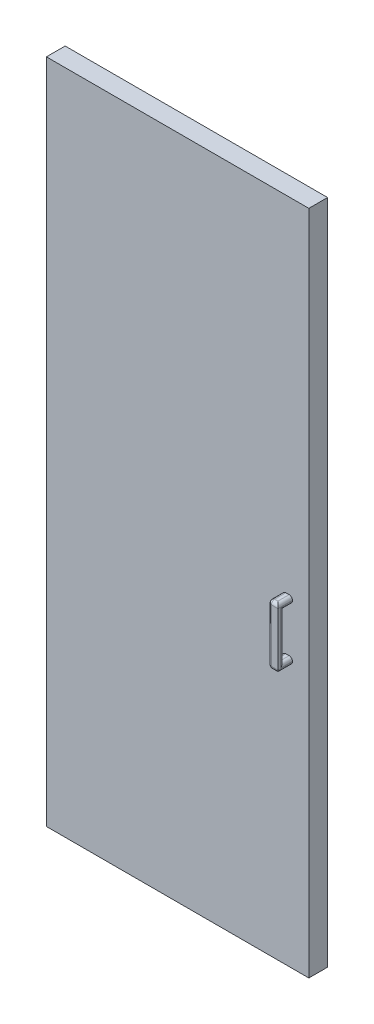
ISO-10303-21;
HEADER;
FILE_DESCRIPTION(('STEP AP214'),'2;1');
FILE_NAME('part.step','',(''),(''),'','','');
FILE_SCHEMA(('AUTOMOTIVE_DESIGN { 1 0 10303 214 1 1 1 1 }'));
ENDSEC;
DATA;
#1=APPLICATION_CONTEXT('core data for automotive mechanical design processes');
#2=APPLICATION_PROTOCOL_DEFINITION('international standard','automotive_design',2000,#1);
#3=PRODUCT_CONTEXT('',#1,'mechanical');
#4=PRODUCT('Part','Part','',(#3));
#5=PRODUCT_RELATED_PRODUCT_CATEGORY('part','',(#4));
#6=PRODUCT_DEFINITION_FORMATION('','',#4);
#7=PRODUCT_DEFINITION_CONTEXT('part definition',#1,'design');
#8=PRODUCT_DEFINITION('design','',#6,#7);
#9=PRODUCT_DEFINITION_SHAPE('','',#8);
#10=(LENGTH_UNIT() NAMED_UNIT(*) SI_UNIT(.MILLI.,.METRE.));
#11=(NAMED_UNIT(*) PLANE_ANGLE_UNIT() SI_UNIT($,.RADIAN.));
#12=(NAMED_UNIT(*) SI_UNIT($,.STERADIAN.) SOLID_ANGLE_UNIT());
#13=UNCERTAINTY_MEASURE_WITH_UNIT(LENGTH_MEASURE(1.E-05),#10,'distance_accuracy_value','');
#14=(GEOMETRIC_REPRESENTATION_CONTEXT(3) GLOBAL_UNCERTAINTY_ASSIGNED_CONTEXT((#13)) GLOBAL_UNIT_ASSIGNED_CONTEXT((#10,
#11,#12)) REPRESENTATION_CONTEXT('',''));
#15=CARTESIAN_POINT('',(0.,0.,0.));
#16=DIRECTION('',(0.,0.,1.));
#17=DIRECTION('',(1.,0.,0.));
#18=AXIS2_PLACEMENT_3D('',#15,#16,#17);
#19=CARTESIAN_POINT('',(0.,0.,0.));
#20=DIRECTION('',(0.,0.,1.));
#21=DIRECTION('',(1.,0.,0.));
#22=AXIS2_PLACEMENT_3D('',#19,#20,#21);
#23=PLANE('',#22);
#24=DIRECTION('',(-1.,0.,0.));
#25=VECTOR('',#24,1.);
#26=CARTESIAN_POINT('',(0.,446.201837212028,0.));
#27=LINE('',#26,#25);
#28=CARTESIAN_POINT('',(0.,446.201837212028,0.));
#29=VERTEX_POINT('',#28);
#30=CARTESIAN_POINT('',(-800.,446.201837212028,0.));
#31=VERTEX_POINT('',#30);
#32=EDGE_CURVE('E257',#29,#31,#27,.T.);
#33=ORIENTED_EDGE('',*,*,#32,.F.);
#34=DIRECTION('',(0.,1.,0.));
#35=VECTOR('',#34,1.);
#36=CARTESIAN_POINT('',(0.,0.,0.));
#37=LINE('',#36,#35);
#38=CARTESIAN_POINT('',(0.,-1585.79816278797,0.));
#39=VERTEX_POINT('',#38);
#40=EDGE_CURVE('E275',#39,#29,#37,.T.);
#41=ORIENTED_EDGE('',*,*,#40,.F.);
#42=DIRECTION('',(1.,0.,0.));
#43=VECTOR('',#42,1.);
#44=CARTESIAN_POINT('',(-800.,-1585.79816278797,0.));
#45=LINE('',#44,#43);
#46=CARTESIAN_POINT('',(-800.,-1585.79816278797,0.));
#47=VERTEX_POINT('',#46);
#48=EDGE_CURVE('E286',#47,#39,#45,.T.);
#49=ORIENTED_EDGE('',*,*,#48,.F.);
#50=DIRECTION('',(0.,-1.,0.));
#51=VECTOR('',#50,1.);
#52=CARTESIAN_POINT('',(-800.,446.201837212028,0.));
#53=LINE('',#52,#51);
#54=EDGE_CURVE('E284',#31,#47,#53,.T.);
#55=ORIENTED_EDGE('',*,*,#54,.F.);
#56=EDGE_LOOP('',(#33,#41,#49,#55));
#57=FACE_BOUND('',#56,.T.);
#58=DIRECTION('',(0.,1.,0.));
#59=VECTOR('',#58,1.);
#60=CARTESIAN_POINT('',(-145.,-924.798162787972,0.));
#61=LINE('',#60,#59);
#62=CARTESIAN_POINT('',(-145.,-924.798162787972,0.));
#63=VERTEX_POINT('',#62);
#64=CARTESIAN_POINT('',(-145.,-464.798162787972,0.));
#65=VERTEX_POINT('',#64);
#66=EDGE_CURVE('E233',#63,#65,#61,.T.);
#67=ORIENTED_EDGE('',*,*,#66,.F.);
#68=DIRECTION('',(-1.,0.,0.));
#69=VECTOR('',#68,1.);
#70=CARTESIAN_POINT('',(-25.,-924.798162787972,0.));
#71=LINE('',#70,#69);
#72=CARTESIAN_POINT('',(-25.,-924.798162787972,0.));
#73=VERTEX_POINT('',#72);
#74=EDGE_CURVE('E230',#73,#63,#71,.T.);
#75=ORIENTED_EDGE('',*,*,#74,.F.);
#76=DIRECTION('',(0.,-1.,0.));
#77=VECTOR('',#76,1.);
#78=CARTESIAN_POINT('',(-25.,-924.798162787972,0.));
#79=LINE('',#78,#77);
#80=CARTESIAN_POINT('',(-25.,-464.798162787972,0.));
#81=VERTEX_POINT('',#80);
#82=EDGE_CURVE('E61',#81,#73,#79,.T.);
#83=ORIENTED_EDGE('',*,*,#82,.F.);
#84=DIRECTION('',(1.,0.,0.));
#85=VECTOR('',#84,1.);
#86=CARTESIAN_POINT('',(-25.,-464.798162787972,0.));
#87=LINE('',#86,#85);
#88=EDGE_CURVE('E56',#65,#81,#87,.T.);
#89=ORIENTED_EDGE('',*,*,#88,.F.);
#90=EDGE_LOOP('',(#67,#75,#83,#89));
#91=FACE_BOUND('',#90,.T.);
#92=ADVANCED_FACE('F39',(#57,#91),#23,.F.);
#93=CARTESIAN_POINT('',(-79.9999999999999,-603.798162787972,101.15));
#94=DIRECTION('',(1.,0.,0.));
#95=DIRECTION('',(0.,1.,0.));
#96=AXIS2_PLACEMENT_3D('',#93,#94,#95);
#97=PLANE('',#96);
#98=DIRECTION('',(0.,-1.,0.));
#99=VECTOR('',#98,1.);
#100=CARTESIAN_POINT('',(-79.9999999999999,-603.798162787972,57.15));
#101=LINE('',#100,#99);
#102=CARTESIAN_POINT('',(-79.9999999999999,-774.798162787972,57.15));
#103=VERTEX_POINT('',#102);
#104=CARTESIAN_POINT('',(-79.9999999999999,-775.798162787972,57.15));
#105=VERTEX_POINT('',#104);
#106=EDGE_CURVE('E265',#103,#105,#101,.T.);
#107=ORIENTED_EDGE('',*,*,#106,.T.);
#108=DIRECTION('',(0.,0.,-1.));
#109=VECTOR('',#108,1.);
#110=CARTESIAN_POINT('',(-79.9999999999999,-775.798162787972,101.15));
#111=LINE('',#110,#109);
#112=CARTESIAN_POINT('',(-79.9999999999999,-775.798162787972,91.15));
#113=VERTEX_POINT('',#112);
#114=EDGE_CURVE('E328',#105,#113,#111,.F.);
#115=ORIENTED_EDGE('',*,*,#114,.T.);
#116=DIRECTION('',(0.,-1.,0.));
#117=VECTOR('',#116,1.);
#118=CARTESIAN_POINT('',(-79.9999999999999,-603.798162787972,91.15));
#119=LINE('',#118,#117);
#120=CARTESIAN_POINT('',(-79.9999999999999,-774.798162787972,91.15));
#121=VERTEX_POINT('',#120);
#122=EDGE_CURVE('E324',#113,#121,#119,.F.);
#123=ORIENTED_EDGE('',*,*,#122,.T.);
#124=DIRECTION('',(0.,0.,-1.));
#125=VECTOR('',#124,1.);
#126=CARTESIAN_POINT('',(-79.9999999999999,-774.798162787972,57.15));
#127=LINE('',#126,#125);
#128=EDGE_CURVE('E326',#121,#103,#127,.T.);
#129=ORIENTED_EDGE('',*,*,#128,.T.);
#130=EDGE_LOOP('',(#107,#115,#123,#129));
#131=FACE_BOUND('',#130,.T.);
#132=ADVANCED_FACE('F497',(#131),#97,.F.);
#133=CARTESIAN_POINT('',(-49.9999999999999,-603.798162787972,101.15));
#134=DIRECTION('',(-1.,0.,0.));
#135=DIRECTION('',(0.,-1.,0.));
#136=AXIS2_PLACEMENT_3D('',#133,#134,#135);
#137=PLANE('',#136);
#138=DIRECTION('',(0.,1.,0.));
#139=VECTOR('',#138,1.);
#140=CARTESIAN_POINT('',(-49.9999999999999,-603.798162787972,57.15));
#141=LINE('',#140,#139);
#142=CARTESIAN_POINT('',(-49.9999999999999,-614.798162787972,57.15));
#143=VERTEX_POINT('',#142);
#144=CARTESIAN_POINT('',(-49.9999999999999,-613.798162787972,57.15));
#145=VERTEX_POINT('',#144);
#146=EDGE_CURVE('E243',#143,#145,#141,.T.);
#147=ORIENTED_EDGE('',*,*,#146,.T.);
#148=DIRECTION('',(0.,0.,-1.));
#149=VECTOR('',#148,1.);
#150=CARTESIAN_POINT('',(-49.9999999999999,-613.798162787972,101.15));
#151=LINE('',#150,#149);
#152=CARTESIAN_POINT('',(-49.9999999999999,-613.798162787972,101.15));
#153=VERTEX_POINT('',#152);
#154=EDGE_CURVE('E343',#145,#153,#151,.F.);
#155=ORIENTED_EDGE('',*,*,#154,.T.);
#156=DIRECTION('',(0.,1.,0.));
#157=VECTOR('',#156,1.);
#158=CARTESIAN_POINT('',(-49.9999999999999,-603.798162787972,101.15));
#159=LINE('',#158,#157);
#160=CARTESIAN_POINT('',(-49.9999999999999,-775.798162787972,101.15));
#161=VERTEX_POINT('',#160);
#162=EDGE_CURVE('E254',#161,#153,#159,.T.);
#163=ORIENTED_EDGE('',*,*,#162,.F.);
#164=DIRECTION('',(0.,0.,-1.));
#165=VECTOR('',#164,1.);
#166=CARTESIAN_POINT('',(-49.9999999999999,-775.798162787972,101.15));
#167=LINE('',#166,#165);
#168=CARTESIAN_POINT('',(-49.9999999999999,-775.798162787972,57.15));
#169=VERTEX_POINT('',#168);
#170=EDGE_CURVE('E335',#161,#169,#167,.T.);
#171=ORIENTED_EDGE('',*,*,#170,.T.);
#172=CARTESIAN_POINT('',(-49.9999999999999,-774.798162787972,57.15));
#173=VERTEX_POINT('',#172);
#174=EDGE_CURVE('E259',#169,#173,#141,.T.);
#175=ORIENTED_EDGE('',*,*,#174,.T.);
#176=DIRECTION('',(0.,0.,-1.));
#177=VECTOR('',#176,1.);
#178=CARTESIAN_POINT('',(-49.9999999999999,-774.798162787972,83.15));
#179=LINE('',#178,#177);
#180=CARTESIAN_POINT('',(-49.9999999999999,-774.798162787972,93.15));
#181=VERTEX_POINT('',#180);
#182=EDGE_CURVE('E337',#173,#181,#179,.F.);
#183=ORIENTED_EDGE('',*,*,#182,.T.);
#184=DIRECTION('',(0.,-1.,0.));
#185=VECTOR('',#184,1.);
#186=CARTESIAN_POINT('',(-49.9999999999999,-624.798162787972,93.15));
#187=LINE('',#186,#185);
#188=CARTESIAN_POINT('',(-49.9999999999999,-614.798162787972,93.15));
#189=VERTEX_POINT('',#188);
#190=EDGE_CURVE('E339',#181,#189,#187,.F.);
#191=ORIENTED_EDGE('',*,*,#190,.T.);
#192=DIRECTION('',(0.,0.,1.));
#193=VECTOR('',#192,1.);
#194=CARTESIAN_POINT('',(-49.9999999999999,-614.798162787972,57.15));
#195=LINE('',#194,#193);
#196=EDGE_CURVE('E341',#189,#143,#195,.F.);
#197=ORIENTED_EDGE('',*,*,#196,.T.);
#198=EDGE_LOOP('',(#147,#155,#163,#171,#175,#183,#191,#197));
#199=FACE_BOUND('',#198,.T.);
#200=ADVANCED_FACE('F417',(#199),#137,.F.);
#201=DIRECTION('',(0.,-1.,0.));
#202=VECTOR('',#201,1.);
#203=CARTESIAN_POINT('',(-79.9999999999999,-603.798162787972,91.15));
#204=LINE('',#203,#202);
#205=CARTESIAN_POINT('',(-79.9999999999999,-614.798162787972,91.15));
#206=VERTEX_POINT('',#205);
#207=CARTESIAN_POINT('',(-79.9999999999999,-613.798162787972,91.15));
#208=VERTEX_POINT('',#207);
#209=EDGE_CURVE('E318',#206,#208,#204,.F.);
#210=ORIENTED_EDGE('',*,*,#209,.T.);
#211=DIRECTION('',(0.,0.,-1.));
#212=VECTOR('',#211,1.);
#213=CARTESIAN_POINT('',(-79.9999999999999,-613.798162787972,101.15));
#214=LINE('',#213,#212);
#215=CARTESIAN_POINT('',(-79.9999999999999,-613.798162787972,57.15));
#216=VERTEX_POINT('',#215);
#217=EDGE_CURVE('E322',#208,#216,#214,.T.);
#218=ORIENTED_EDGE('',*,*,#217,.T.);
#219=CARTESIAN_POINT('',(-79.9999999999999,-614.798162787972,57.15));
#220=VERTEX_POINT('',#219);
#221=EDGE_CURVE('E266',#216,#220,#101,.T.);
#222=ORIENTED_EDGE('',*,*,#221,.T.);
#223=DIRECTION('',(0.,0.,1.));
#224=VECTOR('',#223,1.);
#225=CARTESIAN_POINT('',(-79.9999999999999,-614.798162787972,83.15));
#226=LINE('',#225,#224);
#227=EDGE_CURVE('E320',#220,#206,#226,.T.);
#228=ORIENTED_EDGE('',*,*,#227,.T.);
#229=EDGE_LOOP('',(#210,#218,#222,#228));
#230=FACE_BOUND('',#229,.T.);
#231=ADVANCED_FACE('F503',(#230),#97,.F.);
#232=CARTESIAN_POINT('',(0.,0.,57.15));
#233=DIRECTION('',(0.,0.,1.));
#234=DIRECTION('',(1.,0.,0.));
#235=AXIS2_PLACEMENT_3D('',#232,#233,#234);
#236=PLANE('',#235);
#237=DIRECTION('',(-1.,0.,0.));
#238=VECTOR('',#237,1.);
#239=CARTESIAN_POINT('',(-35.9999999999999,-764.798162787972,57.15));
#240=LINE('',#239,#238);
#241=CARTESIAN_POINT('',(-59.9999999999999,-764.798162787972,57.15));
#242=VERTEX_POINT('',#241);
#243=CARTESIAN_POINT('',(-69.9999999999999,-764.798162787972,57.15));
#244=VERTEX_POINT('',#243);
#245=EDGE_CURVE('E240',#242,#244,#240,.T.);
#246=ORIENTED_EDGE('',*,*,#245,.F.);
#247=CARTESIAN_POINT('',(-59.9999999999999,-774.798162787972,57.15));
#248=DIRECTION('',(0.,0.,1.));
#249=DIRECTION('',(1.,0.,0.));
#250=AXIS2_PLACEMENT_3D('',#247,#248,#249);
#251=CIRCLE('',#250,10.);
#252=EDGE_CURVE('E363',#242,#173,#251,.F.);
#253=ORIENTED_EDGE('',*,*,#252,.T.);
#254=ORIENTED_EDGE('',*,*,#174,.F.);
#255=CARTESIAN_POINT('',(-59.9999999999999,-775.798162787972,57.15));
#256=DIRECTION('',(0.,0.,1.));
#257=DIRECTION('',(1.,0.,0.));
#258=AXIS2_PLACEMENT_3D('',#255,#256,#257);
#259=CIRCLE('',#258,10.);
#260=CARTESIAN_POINT('',(-59.9999999999999,-785.798162787972,57.15));
#261=VERTEX_POINT('',#260);
#262=EDGE_CURVE('E365',#169,#261,#259,.F.);
#263=ORIENTED_EDGE('',*,*,#262,.T.);
#264=DIRECTION('',(1.,0.,0.));
#265=VECTOR('',#264,1.);
#266=CARTESIAN_POINT('',(-79.9999999999999,-785.798162787972,57.15));
#267=LINE('',#266,#265);
#268=CARTESIAN_POINT('',(-69.9999999999999,-785.798162787972,57.15));
#269=VERTEX_POINT('',#268);
#270=EDGE_CURVE('E258',#269,#261,#267,.T.);
#271=ORIENTED_EDGE('',*,*,#270,.F.);
#272=CARTESIAN_POINT('',(-69.9999999999999,-775.798162787972,57.15));
#273=DIRECTION('',(0.,0.,1.));
#274=DIRECTION('',(1.,0.,0.));
#275=AXIS2_PLACEMENT_3D('',#272,#273,#274);
#276=CIRCLE('',#275,10.);
#277=EDGE_CURVE('E48',#269,#105,#276,.F.);
#278=ORIENTED_EDGE('',*,*,#277,.T.);
#279=ORIENTED_EDGE('',*,*,#106,.F.);
#280=CARTESIAN_POINT('',(-69.9999999999999,-774.798162787972,57.15));
#281=DIRECTION('',(0.,0.,1.));
#282=DIRECTION('',(1.,0.,0.));
#283=AXIS2_PLACEMENT_3D('',#280,#281,#282);
#284=CIRCLE('',#283,10.);
#285=EDGE_CURVE('E11',#103,#244,#284,.F.);
#286=ORIENTED_EDGE('',*,*,#285,.T.);
#287=EDGE_LOOP('',(#246,#253,#254,#263,#271,#278,#279,#286));
#288=FACE_BOUND('',#287,.T.);
#289=ORIENTED_EDGE('',*,*,#146,.F.);
#290=CARTESIAN_POINT('',(-59.9999999999999,-614.798162787972,57.15));
#291=DIRECTION('',(0.,0.,1.));
#292=DIRECTION('',(1.,0.,0.));
#293=AXIS2_PLACEMENT_3D('',#290,#291,#292);
#294=CIRCLE('',#293,10.);
#295=CARTESIAN_POINT('',(-59.9999999999999,-624.798162787972,57.15));
#296=VERTEX_POINT('',#295);
#297=EDGE_CURVE('E361',#143,#296,#294,.F.);
#298=ORIENTED_EDGE('',*,*,#297,.T.);
#299=DIRECTION('',(-1.,0.,0.));
#300=VECTOR('',#299,1.);
#301=CARTESIAN_POINT('',(-35.9999999999999,-624.798162787972,57.15));
#302=LINE('',#301,#300);
#303=CARTESIAN_POINT('',(-69.9999999999999,-624.798162787972,57.15));
#304=VERTEX_POINT('',#303);
#305=EDGE_CURVE('E244',#296,#304,#302,.T.);
#306=ORIENTED_EDGE('',*,*,#305,.T.);
#307=CARTESIAN_POINT('',(-69.9999999999999,-614.798162787972,57.15));
#308=DIRECTION('',(0.,0.,1.));
#309=DIRECTION('',(1.,0.,0.));
#310=AXIS2_PLACEMENT_3D('',#307,#308,#309);
#311=CIRCLE('',#310,10.);
#312=EDGE_CURVE('E357',#304,#220,#311,.F.);
#313=ORIENTED_EDGE('',*,*,#312,.T.);
#314=ORIENTED_EDGE('',*,*,#221,.F.);
#315=CARTESIAN_POINT('',(-69.9999999999999,-613.798162787972,57.15));
#316=DIRECTION('',(0.,0.,1.));
#317=DIRECTION('',(1.,0.,0.));
#318=AXIS2_PLACEMENT_3D('',#315,#316,#317);
#319=CIRCLE('',#318,10.);
#320=CARTESIAN_POINT('',(-69.9999999999999,-603.798162787972,57.15));
#321=VERTEX_POINT('',#320);
#322=EDGE_CURVE('E355',#216,#321,#319,.F.);
#323=ORIENTED_EDGE('',*,*,#322,.T.);
#324=DIRECTION('',(-1.,0.,0.));
#325=VECTOR('',#324,1.);
#326=CARTESIAN_POINT('',(-79.9999999999999,-603.798162787972,57.15));
#327=LINE('',#326,#325);
#328=CARTESIAN_POINT('',(-59.9999999999999,-603.798162787972,57.15));
#329=VERTEX_POINT('',#328);
#330=EDGE_CURVE('E262',#329,#321,#327,.T.);
#331=ORIENTED_EDGE('',*,*,#330,.F.);
#332=CARTESIAN_POINT('',(-59.9999999999999,-613.798162787972,57.15));
#333=DIRECTION('',(0.,0.,1.));
#334=DIRECTION('',(1.,0.,0.));
#335=AXIS2_PLACEMENT_3D('',#332,#333,#334);
#336=CIRCLE('',#335,10.);
#337=EDGE_CURVE('E359',#329,#145,#336,.F.);
#338=ORIENTED_EDGE('',*,*,#337,.T.);
#339=EDGE_LOOP('',(#289,#298,#306,#313,#314,#323,#331,#338));
#340=FACE_BOUND('',#339,.T.);
#341=DIRECTION('',(-1.,0.,0.));
#342=VECTOR('',#341,1.);
#343=CARTESIAN_POINT('',(0.,446.201837212028,57.15));
#344=LINE('',#343,#342);
#345=CARTESIAN_POINT('',(0.,446.201837212028,57.15));
#346=VERTEX_POINT('',#345);
#347=CARTESIAN_POINT('',(-800.,446.201837212028,57.15));
#348=VERTEX_POINT('',#347);
#349=EDGE_CURVE('E271',#346,#348,#344,.T.);
#350=ORIENTED_EDGE('',*,*,#349,.T.);
#351=DIRECTION('',(0.,-1.,0.));
#352=VECTOR('',#351,1.);
#353=CARTESIAN_POINT('',(-800.,446.201837212028,57.15));
#354=LINE('',#353,#352);
#355=CARTESIAN_POINT('',(-800.,-1585.79816278797,57.15));
#356=VERTEX_POINT('',#355);
#357=EDGE_CURVE('E274',#348,#356,#354,.T.);
#358=ORIENTED_EDGE('',*,*,#357,.T.);
#359=DIRECTION('',(1.,0.,0.));
#360=VECTOR('',#359,1.);
#361=CARTESIAN_POINT('',(-800.,-1585.79816278797,57.15));
#362=LINE('',#361,#360);
#363=CARTESIAN_POINT('',(0.,-1585.79816278797,57.15));
#364=VERTEX_POINT('',#363);
#365=EDGE_CURVE('E277',#356,#364,#362,.T.);
#366=ORIENTED_EDGE('',*,*,#365,.T.);
#367=DIRECTION('',(0.,1.,0.));
#368=VECTOR('',#367,1.);
#369=CARTESIAN_POINT('',(0.,-1585.79816278797,57.15));
#370=LINE('',#369,#368);
#371=EDGE_CURVE('E279',#364,#346,#370,.T.);
#372=ORIENTED_EDGE('',*,*,#371,.T.);
#373=EDGE_LOOP('',(#350,#358,#366,#372));
#374=FACE_BOUND('',#373,.T.);
#375=ADVANCED_FACE('F421',(#288,#340,#374),#236,.T.);
#376=CARTESIAN_POINT('',(0.,446.201837212028,57.15));
#377=DIRECTION('',(0.,-1.,0.));
#378=DIRECTION('',(1.,0.,0.));
#379=AXIS2_PLACEMENT_3D('',#376,#377,#378);
#380=PLANE('',#379);
#381=ORIENTED_EDGE('',*,*,#32,.T.);
#382=DIRECTION('',(0.,0.,-1.));
#383=VECTOR('',#382,1.);
#384=CARTESIAN_POINT('',(-800.,446.201837212028,57.15));
#385=LINE('',#384,#383);
#386=EDGE_CURVE('E298',#348,#31,#385,.T.);
#387=ORIENTED_EDGE('',*,*,#386,.F.);
#388=ORIENTED_EDGE('',*,*,#349,.F.);
#389=DIRECTION('',(0.,0.,-1.));
#390=VECTOR('',#389,1.);
#391=CARTESIAN_POINT('',(0.,446.201837212028,57.15));
#392=LINE('',#391,#390);
#393=EDGE_CURVE('E281',#346,#29,#392,.T.);
#394=ORIENTED_EDGE('',*,*,#393,.T.);
#395=EDGE_LOOP('',(#381,#387,#388,#394));
#396=FACE_BOUND('',#395,.T.);
#397=ADVANCED_FACE('F544',(#396),#380,.F.);
#398=CARTESIAN_POINT('',(-800.,446.201837212028,57.15));
#399=DIRECTION('',(1.,0.,0.));
#400=DIRECTION('',(0.,1.,0.));
#401=AXIS2_PLACEMENT_3D('',#398,#399,#400);
#402=PLANE('',#401);
#403=ORIENTED_EDGE('',*,*,#54,.T.);
#404=DIRECTION('',(0.,0.,-1.));
#405=VECTOR('',#404,1.);
#406=CARTESIAN_POINT('',(-800.,-1585.79816278797,57.15));
#407=LINE('',#406,#405);
#408=EDGE_CURVE('E295',#356,#47,#407,.T.);
#409=ORIENTED_EDGE('',*,*,#408,.F.);
#410=ORIENTED_EDGE('',*,*,#357,.F.);
#411=ORIENTED_EDGE('',*,*,#386,.T.);
#412=EDGE_LOOP('',(#403,#409,#410,#411));
#413=FACE_BOUND('',#412,.T.);
#414=ADVANCED_FACE('F540',(#413),#402,.F.);
#415=CARTESIAN_POINT('',(-800.,-1585.79816278797,57.15));
#416=DIRECTION('',(0.,1.,0.));
#417=DIRECTION('',(0.,0.,1.));
#418=AXIS2_PLACEMENT_3D('',#415,#416,#417);
#419=PLANE('',#418);
#420=ORIENTED_EDGE('',*,*,#48,.T.);
#421=DIRECTION('',(0.,0.,-1.));
#422=VECTOR('',#421,1.);
#423=CARTESIAN_POINT('',(0.,-1585.79816278797,57.15));
#424=LINE('',#423,#422);
#425=EDGE_CURVE('E292',#364,#39,#424,.T.);
#426=ORIENTED_EDGE('',*,*,#425,.F.);
#427=ORIENTED_EDGE('',*,*,#365,.F.);
#428=ORIENTED_EDGE('',*,*,#408,.T.);
#429=EDGE_LOOP('',(#420,#426,#427,#428));
#430=FACE_BOUND('',#429,.T.);
#431=ADVANCED_FACE('F536',(#430),#419,.F.);
#432=CARTESIAN_POINT('',(0.,0.,57.15));
#433=DIRECTION('',(-1.,0.,0.));
#434=DIRECTION('',(0.,0.,1.));
#435=AXIS2_PLACEMENT_3D('',#432,#433,#434);
#436=PLANE('',#435);
#437=ORIENTED_EDGE('',*,*,#40,.T.);
#438=ORIENTED_EDGE('',*,*,#393,.F.);
#439=ORIENTED_EDGE('',*,*,#371,.F.);
#440=ORIENTED_EDGE('',*,*,#425,.T.);
#441=EDGE_LOOP('',(#437,#438,#439,#440));
#442=FACE_BOUND('',#441,.T.);
#443=ADVANCED_FACE('F533',(#442),#436,.F.);
#444=CARTESIAN_POINT('',(-79.9999999999999,-603.798162787972,101.15));
#445=DIRECTION('',(0.,-1.,0.));
#446=DIRECTION('',(0.,0.,-1.));
#447=AXIS2_PLACEMENT_3D('',#444,#445,#446);
#448=PLANE('',#447);
#449=ORIENTED_EDGE('',*,*,#330,.T.);
#450=DIRECTION('',(0.,0.,-1.));
#451=VECTOR('',#450,1.);
#452=CARTESIAN_POINT('',(-69.9999999999999,-603.798162787972,101.15));
#453=LINE('',#452,#451);
#454=CARTESIAN_POINT('',(-69.9999999999999,-603.798162787972,91.15));
#455=VERTEX_POINT('',#454);
#456=EDGE_CURVE('E312',#321,#455,#453,.F.);
#457=ORIENTED_EDGE('',*,*,#456,.T.);
#458=DIRECTION('',(-1.,0.,0.));
#459=VECTOR('',#458,1.);
#460=CARTESIAN_POINT('',(-49.9999999999999,-603.798162787972,91.15));
#461=LINE('',#460,#459);
#462=CARTESIAN_POINT('',(-59.9999999999999,-603.798162787972,91.15));
#463=VERTEX_POINT('',#462);
#464=EDGE_CURVE('E310',#455,#463,#461,.F.);
#465=ORIENTED_EDGE('',*,*,#464,.T.);
#466=DIRECTION('',(0.,0.,-1.));
#467=VECTOR('',#466,1.);
#468=CARTESIAN_POINT('',(-59.9999999999999,-603.798162787972,101.15));
#469=LINE('',#468,#467);
#470=EDGE_CURVE('E308',#463,#329,#469,.T.);
#471=ORIENTED_EDGE('',*,*,#470,.T.);
#472=EDGE_LOOP('',(#449,#457,#465,#471));
#473=FACE_BOUND('',#472,.T.);
#474=ADVANCED_FACE('F511',(#473),#448,.F.);
#475=CARTESIAN_POINT('',(-79.9999999999999,-785.798162787972,101.15));
#476=DIRECTION('',(0.,1.,0.));
#477=DIRECTION('',(0.,0.,1.));
#478=AXIS2_PLACEMENT_3D('',#475,#476,#477);
#479=PLANE('',#478);
#480=ORIENTED_EDGE('',*,*,#270,.T.);
#481=DIRECTION('',(0.,0.,-1.));
#482=VECTOR('',#481,1.);
#483=CARTESIAN_POINT('',(-59.9999999999999,-785.798162787972,101.15));
#484=LINE('',#483,#482);
#485=CARTESIAN_POINT('',(-59.9999999999999,-785.798162787972,91.15));
#486=VERTEX_POINT('',#485);
#487=EDGE_CURVE('E353',#261,#486,#484,.F.);
#488=ORIENTED_EDGE('',*,*,#487,.T.);
#489=DIRECTION('',(1.,0.,0.));
#490=VECTOR('',#489,1.);
#491=CARTESIAN_POINT('',(-79.9999999999999,-785.798162787972,91.15));
#492=LINE('',#491,#490);
#493=CARTESIAN_POINT('',(-69.9999999999999,-785.798162787972,91.15));
#494=VERTEX_POINT('',#493);
#495=EDGE_CURVE('E349',#486,#494,#492,.F.);
#496=ORIENTED_EDGE('',*,*,#495,.T.);
#497=DIRECTION('',(0.,0.,-1.));
#498=VECTOR('',#497,1.);
#499=CARTESIAN_POINT('',(-69.9999999999999,-785.798162787972,101.15));
#500=LINE('',#499,#498);
#501=EDGE_CURVE('E351',#494,#269,#500,.T.);
#502=ORIENTED_EDGE('',*,*,#501,.T.);
#503=EDGE_LOOP('',(#480,#488,#496,#502));
#504=FACE_BOUND('',#503,.T.);
#505=ADVANCED_FACE('F492',(#504),#479,.F.);
#506=CARTESIAN_POINT('',(0.,0.,101.15));
#507=DIRECTION('',(0.,0.,1.));
#508=DIRECTION('',(1.,0.,0.));
#509=AXIS2_PLACEMENT_3D('',#506,#507,#508);
#510=PLANE('',#509);
#511=ORIENTED_EDGE('',*,*,#162,.T.);
#512=DIRECTION('',(-1.,0.,0.));
#513=VECTOR('',#512,1.);
#514=CARTESIAN_POINT('',(-79.9999999999999,-613.798162787972,101.15));
#515=LINE('',#514,#513);
#516=CARTESIAN_POINT('',(-69.9999999999999,-613.798162787972,101.15));
#517=VERTEX_POINT('',#516);
#518=EDGE_CURVE('E305',#153,#517,#515,.T.);
#519=ORIENTED_EDGE('',*,*,#518,.T.);
#520=DIRECTION('',(0.,-1.,0.));
#521=VECTOR('',#520,1.);
#522=CARTESIAN_POINT('',(-69.9999999999999,-785.798162787972,101.15));
#523=LINE('',#522,#521);
#524=CARTESIAN_POINT('',(-69.9999999999999,-775.798162787972,101.15));
#525=VERTEX_POINT('',#524);
#526=EDGE_CURVE('E303',#517,#525,#523,.T.);
#527=ORIENTED_EDGE('',*,*,#526,.T.);
#528=DIRECTION('',(1.,0.,0.));
#529=VECTOR('',#528,1.);
#530=CARTESIAN_POINT('',(-49.9999999999999,-775.798162787972,101.15));
#531=LINE('',#530,#529);
#532=EDGE_CURVE('E301',#525,#161,#531,.T.);
#533=ORIENTED_EDGE('',*,*,#532,.T.);
#534=EDGE_LOOP('',(#511,#519,#527,#533));
#535=FACE_BOUND('',#534,.T.);
#536=ADVANCED_FACE('F475',(#535),#510,.T.);
#537=CARTESIAN_POINT('',(-35.9999999999999,-764.798162787972,0.));
#538=DIRECTION('',(0.,1.,0.));
#539=DIRECTION('',(-1.,0.,0.));
#540=AXIS2_PLACEMENT_3D('',#537,#538,#539);
#541=PLANE('',#540);
#542=DIRECTION('',(-1.,0.,0.));
#543=VECTOR('',#542,1.);
#544=CARTESIAN_POINT('',(-35.9999999999999,-764.798162787972,83.15));
#545=LINE('',#544,#543);
#546=CARTESIAN_POINT('',(-59.9999999999999,-764.798162787972,83.15));
#547=VERTEX_POINT('',#546);
#548=CARTESIAN_POINT('',(-69.9999999999999,-764.798162787972,83.15));
#549=VERTEX_POINT('',#548);
#550=EDGE_CURVE('E250',#547,#549,#545,.T.);
#551=ORIENTED_EDGE('',*,*,#550,.F.);
#552=DIRECTION('',(0.,0.,-1.));
#553=VECTOR('',#552,1.);
#554=CARTESIAN_POINT('',(-59.9999999999999,-764.798162787972,57.15));
#555=LINE('',#554,#553);
#556=EDGE_CURVE('E347',#547,#242,#555,.T.);
#557=ORIENTED_EDGE('',*,*,#556,.T.);
#558=ORIENTED_EDGE('',*,*,#245,.T.);
#559=DIRECTION('',(0.,0.,-1.));
#560=VECTOR('',#559,1.);
#561=CARTESIAN_POINT('',(-69.9999999999999,-764.798162787972,83.15));
#562=LINE('',#561,#560);
#563=EDGE_CURVE('E345',#244,#549,#562,.F.);
#564=ORIENTED_EDGE('',*,*,#563,.T.);
#565=EDGE_LOOP('',(#551,#557,#558,#564));
#566=FACE_BOUND('',#565,.T.);
#567=ADVANCED_FACE('F575',(#566),#541,.T.);
#568=CARTESIAN_POINT('',(-35.9999999999999,-624.798162787972,0.));
#569=DIRECTION('',(0.,-1.,0.));
#570=DIRECTION('',(1.,0.,0.));
#571=AXIS2_PLACEMENT_3D('',#568,#569,#570);
#572=PLANE('',#571);
#573=DIRECTION('',(-1.,0.,0.));
#574=VECTOR('',#573,1.);
#575=CARTESIAN_POINT('',(-35.9999999999999,-624.798162787972,83.15));
#576=LINE('',#575,#574);
#577=CARTESIAN_POINT('',(-59.9999999999999,-624.798162787972,83.15));
#578=VERTEX_POINT('',#577);
#579=CARTESIAN_POINT('',(-69.9999999999999,-624.798162787972,83.15));
#580=VERTEX_POINT('',#579);
#581=EDGE_CURVE('E247',#578,#580,#576,.T.);
#582=ORIENTED_EDGE('',*,*,#581,.T.);
#583=DIRECTION('',(0.,0.,1.));
#584=VECTOR('',#583,1.);
#585=CARTESIAN_POINT('',(-69.9999999999999,-624.798162787972,57.15));
#586=LINE('',#585,#584);
#587=EDGE_CURVE('E333',#580,#304,#586,.F.);
#588=ORIENTED_EDGE('',*,*,#587,.T.);
#589=ORIENTED_EDGE('',*,*,#305,.F.);
#590=DIRECTION('',(0.,0.,1.));
#591=VECTOR('',#590,1.);
#592=CARTESIAN_POINT('',(-59.9999999999999,-624.798162787972,83.15));
#593=LINE('',#592,#591);
#594=EDGE_CURVE('E330',#296,#578,#593,.T.);
#595=ORIENTED_EDGE('',*,*,#594,.T.);
#596=EDGE_LOOP('',(#582,#588,#589,#595));
#597=FACE_BOUND('',#596,.T.);
#598=ADVANCED_FACE('F445',(#597),#572,.T.);
#599=CARTESIAN_POINT('',(-36.0000000000001,0.,83.1499999999999));
#600=DIRECTION('',(0.,0.,-1.));
#601=DIRECTION('',(0.,1.,0.));
#602=AXIS2_PLACEMENT_3D('',#599,#600,#601);
#603=PLANE('',#602);
#604=ORIENTED_EDGE('',*,*,#550,.T.);
#605=DIRECTION('',(0.,-1.,0.));
#606=VECTOR('',#605,1.);
#607=CARTESIAN_POINT('',(-69.9999999999999,-624.798162787972,83.15));
#608=LINE('',#607,#606);
#609=EDGE_CURVE('E316',#549,#580,#608,.F.);
#610=ORIENTED_EDGE('',*,*,#609,.T.);
#611=ORIENTED_EDGE('',*,*,#581,.F.);
#612=DIRECTION('',(0.,-1.,0.));
#613=VECTOR('',#612,1.);
#614=CARTESIAN_POINT('',(-59.9999999999999,-764.798162787972,83.15));
#615=LINE('',#614,#613);
#616=EDGE_CURVE('E314',#578,#547,#615,.T.);
#617=ORIENTED_EDGE('',*,*,#616,.T.);
#618=EDGE_LOOP('',(#604,#610,#611,#617));
#619=FACE_BOUND('',#618,.T.);
#620=ADVANCED_FACE('F447',(#619),#603,.T.);
#621=CARTESIAN_POINT('',(-59.9999999999999,-775.798162787972,101.15));
#622=DIRECTION('',(0.,0.,-1.));
#623=DIRECTION('',(-1.,0.,0.));
#624=AXIS2_PLACEMENT_3D('',#621,#622,#623);
#625=CYLINDRICAL_SURFACE('',#624,10.);
#626=ORIENTED_EDGE('',*,*,#262,.F.);
#627=ORIENTED_EDGE('',*,*,#170,.F.);
#628=CARTESIAN_POINT('',(-59.9999999999999,-775.798162787972,91.15));
#629=DIRECTION('',(-0.707106781186547,0.,0.707106781186547));
#630=DIRECTION('',(-0.707106781186547,0.,-0.707106781186547));
#631=AXIS2_PLACEMENT_3D('',#628,#629,#630);
#632=ELLIPSE('',#631,14.1421356237309,10.);
#633=EDGE_CURVE('E253',#486,#161,#632,.T.);
#634=ORIENTED_EDGE('',*,*,#633,.F.);
#635=ORIENTED_EDGE('',*,*,#487,.F.);
#636=EDGE_LOOP('',(#626,#627,#634,#635));
#637=FACE_BOUND('',#636,.T.);
#638=ADVANCED_FACE('F412',(#637),#625,.T.);
#639=CARTESIAN_POINT('',(0.,-775.798162787972,91.15));
#640=DIRECTION('',(-1.,0.,0.));
#641=DIRECTION('',(0.,0.,1.));
#642=AXIS2_PLACEMENT_3D('',#639,#640,#641);
#643=CYLINDRICAL_SURFACE('',#642,10.);
#644=ORIENTED_EDGE('',*,*,#633,.T.);
#645=ORIENTED_EDGE('',*,*,#532,.F.);
#646=CARTESIAN_POINT('',(-69.9999999999999,-775.798162787972,91.15));
#647=DIRECTION('',(-1.,0.,0.));
#648=DIRECTION('',(0.,0.,1.));
#649=AXIS2_PLACEMENT_3D('',#646,#647,#648);
#650=CIRCLE('',#649,10.);
#651=EDGE_CURVE('E398',#494,#525,#650,.T.);
#652=ORIENTED_EDGE('',*,*,#651,.F.);
#653=ORIENTED_EDGE('',*,*,#495,.F.);
#654=EDGE_LOOP('',(#644,#645,#652,#653));
#655=FACE_BOUND('',#654,.T.);
#656=ADVANCED_FACE('F406',(#655),#643,.T.);
#657=CARTESIAN_POINT('',(-69.9999999999999,-775.798162787972,101.15));
#658=DIRECTION('',(0.,0.,-1.));
#659=DIRECTION('',(-1.,0.,0.));
#660=AXIS2_PLACEMENT_3D('',#657,#658,#659);
#661=CYLINDRICAL_SURFACE('',#660,10.);
#662=ORIENTED_EDGE('',*,*,#277,.F.);
#663=ORIENTED_EDGE('',*,*,#501,.F.);
#664=CARTESIAN_POINT('',(-69.9999999999999,-775.798162787972,91.15));
#665=DIRECTION('',(0.,0.,1.));
#666=DIRECTION('',(1.,0.,0.));
#667=AXIS2_PLACEMENT_3D('',#664,#665,#666);
#668=CIRCLE('',#667,10.);
#669=EDGE_CURVE('E395',#113,#494,#668,.T.);
#670=ORIENTED_EDGE('',*,*,#669,.F.);
#671=ORIENTED_EDGE('',*,*,#114,.F.);
#672=EDGE_LOOP('',(#662,#663,#670,#671));
#673=FACE_BOUND('',#672,.T.);
#674=ADVANCED_FACE('F490',(#673),#661,.T.);
#675=CARTESIAN_POINT('',(-69.9999999999999,-775.798162787972,91.15));
#676=DIRECTION('',(0.,-1.,0.));
#677=DIRECTION('',(0.,0.,-1.));
#678=AXIS2_PLACEMENT_3D('',#675,#676,#677);
#679=SPHERICAL_SURFACE('',#678,10.);
#680=ORIENTED_EDGE('',*,*,#669,.T.);
#681=ORIENTED_EDGE('',*,*,#651,.T.);
#682=CARTESIAN_POINT('',(-69.9999999999999,-775.798162787972,91.15));
#683=DIRECTION('',(0.,-1.,0.));
#684=DIRECTION('',(0.,0.,-1.));
#685=AXIS2_PLACEMENT_3D('',#682,#683,#684);
#686=CIRCLE('',#685,10.);
#687=EDGE_CURVE('E388',#113,#525,#686,.F.);
#688=ORIENTED_EDGE('',*,*,#687,.F.);
#689=EDGE_LOOP('',(#680,#681,#688));
#690=FACE_BOUND('',#689,.T.);
#691=ADVANCED_FACE('F484',(#690),#679,.T.);
#692=CARTESIAN_POINT('',(-69.9999999999999,-774.798162787972,101.15));
#693=DIRECTION('',(0.,0.,1.));
#694=DIRECTION('',(1.,0.,0.));
#695=AXIS2_PLACEMENT_3D('',#692,#693,#694);
#696=CYLINDRICAL_SURFACE('',#695,10.);
#697=CARTESIAN_POINT('',(-69.9999999999999,-774.798162787972,93.15));
#698=DIRECTION('',(0.,0.707106781186548,0.707106781186547));
#699=DIRECTION('',(0.,0.707106781186547,-0.707106781186547));
#700=AXIS2_PLACEMENT_3D('',#697,#698,#699);
#701=ELLIPSE('',#700,14.142135623731,10.);
#702=CARTESIAN_POINT('',(-79.9498743710661,-773.798162787972,92.15));
#703=VERTEX_POINT('',#702);
#704=EDGE_CURVE('E393',#549,#703,#701,.T.);
#705=ORIENTED_EDGE('',*,*,#704,.F.);
#706=ORIENTED_EDGE('',*,*,#563,.F.);
#707=ORIENTED_EDGE('',*,*,#285,.F.);
#708=ORIENTED_EDGE('',*,*,#128,.F.);
#709=CARTESIAN_POINT('',(-69.9999999999999,-774.798162787972,91.15));
#710=DIRECTION('',(0.,-0.707106781186547,0.707106781186547));
#711=DIRECTION('',(0.,0.707106781186547,0.707106781186547));
#712=AXIS2_PLACEMENT_3D('',#709,#710,#711);
#713=ELLIPSE('',#712,14.1421356237309,10.);
#714=EDGE_CURVE('E385',#703,#121,#713,.T.);
#715=ORIENTED_EDGE('',*,*,#714,.F.);
#716=EDGE_LOOP('',(#705,#706,#707,#708,#715));
#717=FACE_BOUND('',#716,.T.);
#718=ADVANCED_FACE('F500',(#717),#696,.T.);
#719=CARTESIAN_POINT('',(-69.9999999999999,-603.798162787972,93.15));
#720=DIRECTION('',(0.,1.,0.));
#721=DIRECTION('',(-1.,0.,0.));
#722=AXIS2_PLACEMENT_3D('',#719,#720,#721);
#723=CYLINDRICAL_SURFACE('',#722,10.);
#724=CARTESIAN_POINT('',(-69.9999999999999,-614.798162787972,93.15));
#725=DIRECTION('',(0.,0.707106781186547,-0.707106781186547));
#726=DIRECTION('',(0.,0.707106781186548,0.707106781186547));
#727=AXIS2_PLACEMENT_3D('',#724,#725,#726);
#728=ELLIPSE('',#727,14.1421356237309,10.);
#729=CARTESIAN_POINT('',(-79.9498743710661,-615.798162787972,92.15));
#730=VERTEX_POINT('',#729);
#731=EDGE_CURVE('E391',#580,#730,#728,.T.);
#732=ORIENTED_EDGE('',*,*,#731,.F.);
#733=ORIENTED_EDGE('',*,*,#609,.F.);
#734=ORIENTED_EDGE('',*,*,#704,.T.);
#735=DIRECTION('',(0.,1.,0.));
#736=VECTOR('',#735,1.);
#737=CARTESIAN_POINT('',(-79.9498743710661,-694.798162787972,92.15));
#738=LINE('',#737,#736);
#739=EDGE_CURVE('E382',#730,#703,#738,.F.);
#740=ORIENTED_EDGE('',*,*,#739,.F.);
#741=EDGE_LOOP('',(#732,#733,#734,#740));
#742=FACE_BOUND('',#741,.T.);
#743=ADVANCED_FACE('F451',(#742),#723,.T.);
#744=CARTESIAN_POINT('',(-69.9999999999999,-614.798162787972,101.15));
#745=DIRECTION('',(0.,0.,-1.));
#746=DIRECTION('',(-1.,0.,0.));
#747=AXIS2_PLACEMENT_3D('',#744,#745,#746);
#748=CYLINDRICAL_SURFACE('',#747,10.);
#749=ORIENTED_EDGE('',*,*,#587,.F.);
#750=ORIENTED_EDGE('',*,*,#731,.T.);
#751=CARTESIAN_POINT('',(-69.9999999999999,-614.798162787972,91.15));
#752=DIRECTION('',(0.,-0.707106781186547,-0.707106781186547));
#753=DIRECTION('',(0.,0.707106781186547,-0.707106781186547));
#754=AXIS2_PLACEMENT_3D('',#751,#752,#753);
#755=ELLIPSE('',#754,14.1421356237309,10.);
#756=EDGE_CURVE('E379',#206,#730,#755,.F.);
#757=ORIENTED_EDGE('',*,*,#756,.F.);
#758=ORIENTED_EDGE('',*,*,#227,.F.);
#759=ORIENTED_EDGE('',*,*,#312,.F.);
#760=EDGE_LOOP('',(#749,#750,#757,#758,#759));
#761=FACE_BOUND('',#760,.T.);
#762=ADVANCED_FACE('F458',(#761),#748,.T.);
#763=CARTESIAN_POINT('',(-70.,0.,91.15));
#764=DIRECTION('',(0.,1.,0.));
#765=DIRECTION('',(-1.,0.,0.));
#766=AXIS2_PLACEMENT_3D('',#763,#764,#765);
#767=CYLINDRICAL_SURFACE('',#766,10.);
#768=ORIENTED_EDGE('',*,*,#687,.T.);
#769=ORIENTED_EDGE('',*,*,#526,.F.);
#770=CARTESIAN_POINT('',(-69.9999999999999,-613.798162787972,91.15));
#771=DIRECTION('',(0.,1.,0.));
#772=DIRECTION('',(0.,0.,1.));
#773=AXIS2_PLACEMENT_3D('',#770,#771,#772);
#774=CIRCLE('',#773,10.);
#775=EDGE_CURVE('E376',#208,#517,#774,.T.);
#776=ORIENTED_EDGE('',*,*,#775,.F.);
#777=ORIENTED_EDGE('',*,*,#209,.F.);
#778=ORIENTED_EDGE('',*,*,#756,.T.);
#779=ORIENTED_EDGE('',*,*,#739,.T.);
#780=ORIENTED_EDGE('',*,*,#714,.T.);
#781=ORIENTED_EDGE('',*,*,#122,.F.);
#782=EDGE_LOOP('',(#768,#769,#776,#777,#778,#779,#780,#781));
#783=FACE_BOUND('',#782,.T.);
#784=ADVANCED_FACE('F479',(#783),#767,.T.);
#785=CARTESIAN_POINT('',(-69.9999999999999,-613.798162787972,101.15));
#786=DIRECTION('',(0.,0.,-1.));
#787=DIRECTION('',(-1.,0.,0.));
#788=AXIS2_PLACEMENT_3D('',#785,#786,#787);
#789=CYLINDRICAL_SURFACE('',#788,10.);
#790=ORIENTED_EDGE('',*,*,#322,.F.);
#791=ORIENTED_EDGE('',*,*,#217,.F.);
#792=CARTESIAN_POINT('',(-69.9999999999999,-613.798162787972,91.15));
#793=DIRECTION('',(0.,0.,1.));
#794=DIRECTION('',(1.,0.,0.));
#795=AXIS2_PLACEMENT_3D('',#792,#793,#794);
#796=CIRCLE('',#795,10.);
#797=EDGE_CURVE('E373',#455,#208,#796,.T.);
#798=ORIENTED_EDGE('',*,*,#797,.F.);
#799=ORIENTED_EDGE('',*,*,#456,.F.);
#800=EDGE_LOOP('',(#790,#791,#798,#799));
#801=FACE_BOUND('',#800,.T.);
#802=ADVANCED_FACE('F508',(#801),#789,.T.);
#803=CARTESIAN_POINT('',(-59.9999999999999,-613.798162787972,101.15));
#804=DIRECTION('',(0.,0.,-1.));
#805=DIRECTION('',(-1.,0.,0.));
#806=AXIS2_PLACEMENT_3D('',#803,#804,#805);
#807=CYLINDRICAL_SURFACE('',#806,10.);
#808=ORIENTED_EDGE('',*,*,#337,.F.);
#809=ORIENTED_EDGE('',*,*,#470,.F.);
#810=CARTESIAN_POINT('',(-59.9999999999999,-613.798162787972,91.15));
#811=DIRECTION('',(0.707106781186547,0.,-0.707106781186547));
#812=DIRECTION('',(-0.707106781186547,0.,-0.707106781186547));
#813=AXIS2_PLACEMENT_3D('',#810,#811,#812);
#814=ELLIPSE('',#813,14.1421356237309,10.);
#815=EDGE_CURVE('E370',#153,#463,#814,.F.);
#816=ORIENTED_EDGE('',*,*,#815,.F.);
#817=ORIENTED_EDGE('',*,*,#154,.F.);
#818=EDGE_LOOP('',(#808,#809,#816,#817));
#819=FACE_BOUND('',#818,.T.);
#820=ADVANCED_FACE('F467',(#819),#807,.T.);
#821=CARTESIAN_POINT('',(-69.9999999999999,-613.798162787972,91.15));
#822=DIRECTION('',(-1.,0.,0.));
#823=DIRECTION('',(0.,0.,1.));
#824=AXIS2_PLACEMENT_3D('',#821,#822,#823);
#825=SPHERICAL_SURFACE('',#824,10.);
#826=ORIENTED_EDGE('',*,*,#797,.T.);
#827=ORIENTED_EDGE('',*,*,#775,.T.);
#828=CARTESIAN_POINT('',(-69.9999999999999,-613.798162787972,91.15));
#829=DIRECTION('',(-1.,0.,0.));
#830=DIRECTION('',(0.,0.,1.));
#831=AXIS2_PLACEMENT_3D('',#828,#829,#830);
#832=CIRCLE('',#831,10.);
#833=EDGE_CURVE('E368',#455,#517,#832,.F.);
#834=ORIENTED_EDGE('',*,*,#833,.F.);
#835=EDGE_LOOP('',(#826,#827,#834));
#836=FACE_BOUND('',#835,.T.);
#837=ADVANCED_FACE('F513',(#836),#825,.T.);
#838=CARTESIAN_POINT('',(0.,-613.798162787972,91.15));
#839=DIRECTION('',(1.,0.,0.));
#840=DIRECTION('',(0.,0.,-1.));
#841=AXIS2_PLACEMENT_3D('',#838,#839,#840);
#842=CYLINDRICAL_SURFACE('',#841,10.);
#843=ORIENTED_EDGE('',*,*,#815,.T.);
#844=ORIENTED_EDGE('',*,*,#464,.F.);
#845=ORIENTED_EDGE('',*,*,#833,.T.);
#846=ORIENTED_EDGE('',*,*,#518,.F.);
#847=EDGE_LOOP('',(#843,#844,#845,#846));
#848=FACE_BOUND('',#847,.T.);
#849=ADVANCED_FACE('F472',(#848),#842,.T.);
#850=CARTESIAN_POINT('',(-59.9999999999999,-774.798162787972,0.));
#851=DIRECTION('',(0.,0.,1.));
#852=DIRECTION('',(1.,0.,0.));
#853=AXIS2_PLACEMENT_3D('',#850,#851,#852);
#854=CYLINDRICAL_SURFACE('',#853,10.);
#855=ORIENTED_EDGE('',*,*,#252,.F.);
#856=ORIENTED_EDGE('',*,*,#556,.F.);
#857=CARTESIAN_POINT('',(-59.9999999999999,-774.798162787972,93.15));
#858=DIRECTION('',(0.,0.707106781186548,0.707106781186547));
#859=DIRECTION('',(0.,0.707106781186547,-0.707106781186547));
#860=AXIS2_PLACEMENT_3D('',#857,#858,#859);
#861=ELLIPSE('',#860,14.142135623731,10.);
#862=EDGE_CURVE('E43',#181,#547,#861,.T.);
#863=ORIENTED_EDGE('',*,*,#862,.F.);
#864=ORIENTED_EDGE('',*,*,#182,.F.);
#865=EDGE_LOOP('',(#855,#856,#863,#864));
#866=FACE_BOUND('',#865,.T.);
#867=ADVANCED_FACE('F41',(#866),#854,.T.);
#868=CARTESIAN_POINT('',(-60.,0.,93.1499999999999));
#869=DIRECTION('',(0.,1.,0.));
#870=DIRECTION('',(-1.,0.,0.));
#871=AXIS2_PLACEMENT_3D('',#868,#869,#870);
#872=CYLINDRICAL_SURFACE('',#871,10.);
#873=ORIENTED_EDGE('',*,*,#862,.T.);
#874=ORIENTED_EDGE('',*,*,#616,.F.);
#875=CARTESIAN_POINT('',(-59.9999999999999,-614.798162787972,93.15));
#876=DIRECTION('',(0.,0.707106781186547,-0.707106781186547));
#877=DIRECTION('',(0.,-0.707106781186548,-0.707106781186547));
#878=AXIS2_PLACEMENT_3D('',#875,#876,#877);
#879=ELLIPSE('',#878,14.1421356237309,10.);
#880=EDGE_CURVE('E234',#189,#578,#879,.T.);
#881=ORIENTED_EDGE('',*,*,#880,.F.);
#882=ORIENTED_EDGE('',*,*,#190,.F.);
#883=EDGE_LOOP('',(#873,#874,#881,#882));
#884=FACE_BOUND('',#883,.T.);
#885=ADVANCED_FACE('F439',(#884),#872,.T.);
#886=CARTESIAN_POINT('',(-59.9999999999999,-614.798162787972,0.));
#887=DIRECTION('',(0.,0.,-1.));
#888=DIRECTION('',(-1.,0.,0.));
#889=AXIS2_PLACEMENT_3D('',#886,#887,#888);
#890=CYLINDRICAL_SURFACE('',#889,10.);
#891=ORIENTED_EDGE('',*,*,#297,.F.);
#892=ORIENTED_EDGE('',*,*,#196,.F.);
#893=ORIENTED_EDGE('',*,*,#880,.T.);
#894=ORIENTED_EDGE('',*,*,#594,.F.);
#895=EDGE_LOOP('',(#891,#892,#893,#894));
#896=FACE_BOUND('',#895,.T.);
#897=ADVANCED_FACE('F436',(#896),#890,.T.);
#898=CARTESIAN_POINT('',(-145.,-924.798162787972,-10.));
#899=DIRECTION('',(1.,0.,0.));
#900=DIRECTION('',(0.,0.,-1.));
#901=AXIS2_PLACEMENT_3D('',#898,#899,#900);
#902=PLANE('',#901);
#903=ORIENTED_EDGE('',*,*,#66,.T.);
#904=DIRECTION('',(0.,0.,1.));
#905=VECTOR('',#904,1.);
#906=CARTESIAN_POINT('',(-145.,-464.798162787972,-10.));
#907=LINE('',#906,#905);
#908=CARTESIAN_POINT('',(-145.,-464.798162787972,-10.));
#909=VERTEX_POINT('',#908);
#910=EDGE_CURVE('E214',#909,#65,#907,.T.);
#911=ORIENTED_EDGE('',*,*,#910,.F.);
#912=DIRECTION('',(0.,1.,0.));
#913=VECTOR('',#912,1.);
#914=CARTESIAN_POINT('',(-145.,-924.798162787972,-10.));
#915=LINE('',#914,#913);
#916=CARTESIAN_POINT('',(-145.,-924.798162787972,-10.));
#917=VERTEX_POINT('',#916);
#918=EDGE_CURVE('E221',#917,#909,#915,.T.);
#919=ORIENTED_EDGE('',*,*,#918,.F.);
#920=DIRECTION('',(0.,0.,1.));
#921=VECTOR('',#920,1.);
#922=CARTESIAN_POINT('',(-145.,-924.798162787972,-10.));
#923=LINE('',#922,#921);
#924=EDGE_CURVE('E899',#917,#63,#923,.T.);
#925=ORIENTED_EDGE('',*,*,#924,.T.);
#926=EDGE_LOOP('',(#903,#911,#919,#925));
#927=FACE_BOUND('',#926,.T.);
#928=ADVANCED_FACE('F232',(#927),#902,.F.);
#929=CARTESIAN_POINT('',(-25.,-464.798162787972,-10.));
#930=DIRECTION('',(0.,-1.,0.));
#931=DIRECTION('',(0.,0.,-1.));
#932=AXIS2_PLACEMENT_3D('',#929,#930,#931);
#933=PLANE('',#932);
#934=ORIENTED_EDGE('',*,*,#88,.T.);
#935=DIRECTION('',(0.,0.,1.));
#936=VECTOR('',#935,1.);
#937=CARTESIAN_POINT('',(-25.,-464.798162787972,-10.));
#938=LINE('',#937,#936);
#939=CARTESIAN_POINT('',(-25.,-464.798162787972,-10.));
#940=VERTEX_POINT('',#939);
#941=EDGE_CURVE('E217',#940,#81,#938,.T.);
#942=ORIENTED_EDGE('',*,*,#941,.F.);
#943=DIRECTION('',(1.,0.,0.));
#944=VECTOR('',#943,1.);
#945=CARTESIAN_POINT('',(-25.,-464.798162787972,-10.));
#946=LINE('',#945,#944);
#947=EDGE_CURVE('E210',#909,#940,#946,.T.);
#948=ORIENTED_EDGE('',*,*,#947,.F.);
#949=ORIENTED_EDGE('',*,*,#910,.T.);
#950=EDGE_LOOP('',(#934,#942,#948,#949));
#951=FACE_BOUND('',#950,.T.);
#952=ADVANCED_FACE('F212',(#951),#933,.F.);
#953=CARTESIAN_POINT('',(-25.,-924.798162787972,-10.));
#954=DIRECTION('',(-1.,0.,0.));
#955=DIRECTION('',(0.,0.,1.));
#956=AXIS2_PLACEMENT_3D('',#953,#954,#955);
#957=PLANE('',#956);
#958=ORIENTED_EDGE('',*,*,#82,.T.);
#959=DIRECTION('',(0.,0.,1.));
#960=VECTOR('',#959,1.);
#961=CARTESIAN_POINT('',(-25.,-924.798162787972,-10.));
#962=LINE('',#961,#960);
#963=CARTESIAN_POINT('',(-25.,-924.798162787972,-10.));
#964=VERTEX_POINT('',#963);
#965=EDGE_CURVE('E236',#964,#73,#962,.T.);
#966=ORIENTED_EDGE('',*,*,#965,.F.);
#967=DIRECTION('',(0.,-1.,0.));
#968=VECTOR('',#967,1.);
#969=CARTESIAN_POINT('',(-25.,-924.798162787972,-10.));
#970=LINE('',#969,#968);
#971=EDGE_CURVE('E220',#940,#964,#970,.T.);
#972=ORIENTED_EDGE('',*,*,#971,.F.);
#973=ORIENTED_EDGE('',*,*,#941,.T.);
#974=EDGE_LOOP('',(#958,#966,#972,#973));
#975=FACE_BOUND('',#974,.T.);
#976=ADVANCED_FACE('F590',(#975),#957,.F.);
#977=CARTESIAN_POINT('',(-25.,-924.798162787972,-10.));
#978=DIRECTION('',(0.,1.,0.));
#979=DIRECTION('',(0.,0.,1.));
#980=AXIS2_PLACEMENT_3D('',#977,#978,#979);
#981=PLANE('',#980);
#982=ORIENTED_EDGE('',*,*,#74,.T.);
#983=ORIENTED_EDGE('',*,*,#924,.F.);
#984=DIRECTION('',(-1.,0.,0.));
#985=VECTOR('',#984,1.);
#986=CARTESIAN_POINT('',(-25.,-924.798162787972,-10.));
#987=LINE('',#986,#985);
#988=EDGE_CURVE('E226',#964,#917,#987,.T.);
#989=ORIENTED_EDGE('',*,*,#988,.F.);
#990=ORIENTED_EDGE('',*,*,#965,.T.);
#991=EDGE_LOOP('',(#982,#983,#989,#990));
#992=FACE_BOUND('',#991,.T.);
#993=ADVANCED_FACE('F593',(#992),#981,.F.);
#994=CARTESIAN_POINT('',(0.,0.,-10.));
#995=DIRECTION('',(0.,0.,1.));
#996=DIRECTION('',(1.,0.,0.));
#997=AXIS2_PLACEMENT_3D('',#994,#995,#996);
#998=PLANE('',#997);
#999=ORIENTED_EDGE('',*,*,#918,.T.);
#1000=ORIENTED_EDGE('',*,*,#947,.T.);
#1001=ORIENTED_EDGE('',*,*,#971,.T.);
#1002=ORIENTED_EDGE('',*,*,#988,.T.);
#1003=EDGE_LOOP('',(#999,#1000,#1001,#1002));
#1004=FACE_BOUND('',#1003,.T.);
#1005=ADVANCED_FACE('F224',(#1004),#998,.F.);
#1006=CLOSED_SHELL('',(#92,#132,#200,#231,#375,#397,#414,#431,#443,#474,#505,#536,#567,#598,
#620,#638,#656,#674,#691,#718,#743,#762,#784,#802,#820,#837,#849,#867,#885,#897,#928,#952,#976,
#993,#1005));
#1007=MANIFOLD_SOLID_BREP('B2',#1006);
#1008=ADVANCED_BREP_SHAPE_REPRESENTATION('',(#18,#1007),#14);
#1009=SHAPE_DEFINITION_REPRESENTATION(#9,#1008);
ENDSEC;
END-ISO-10303-21;
